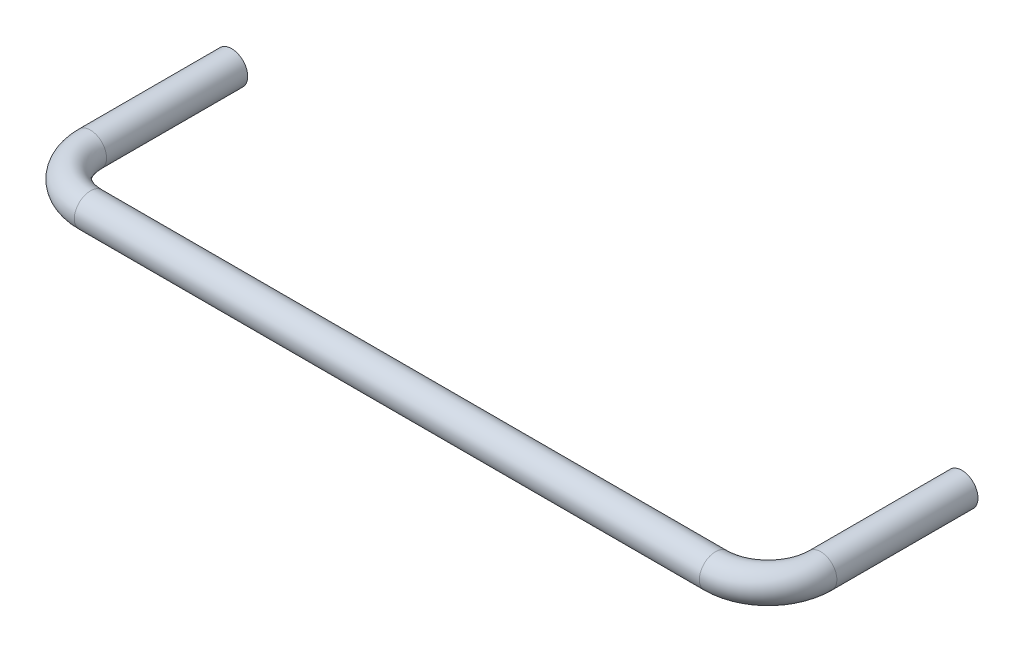
ISO-10303-21;
HEADER;
FILE_DESCRIPTION(('STEP AP214'),'2;1');
FILE_NAME('part.step','',(''),(''),'','','');
FILE_SCHEMA(('AUTOMOTIVE_DESIGN { 1 0 10303 214 1 1 1 1 }'));
ENDSEC;
DATA;
#1=APPLICATION_CONTEXT('core data for automotive mechanical design processes');
#2=APPLICATION_PROTOCOL_DEFINITION('international standard','automotive_design',2000,#1);
#3=PRODUCT_CONTEXT('',#1,'mechanical');
#4=PRODUCT('Part','Part','',(#3));
#5=PRODUCT_RELATED_PRODUCT_CATEGORY('part','',(#4));
#6=PRODUCT_DEFINITION_FORMATION('','',#4);
#7=PRODUCT_DEFINITION_CONTEXT('part definition',#1,'design');
#8=PRODUCT_DEFINITION('design','',#6,#7);
#9=PRODUCT_DEFINITION_SHAPE('','',#8);
#10=(LENGTH_UNIT() NAMED_UNIT(*) SI_UNIT(.MILLI.,.METRE.));
#11=(NAMED_UNIT(*) PLANE_ANGLE_UNIT() SI_UNIT($,.RADIAN.));
#12=(NAMED_UNIT(*) SI_UNIT($,.STERADIAN.) SOLID_ANGLE_UNIT());
#13=UNCERTAINTY_MEASURE_WITH_UNIT(LENGTH_MEASURE(1.E-05),#10,'distance_accuracy_value','');
#14=(GEOMETRIC_REPRESENTATION_CONTEXT(3) GLOBAL_UNCERTAINTY_ASSIGNED_CONTEXT((#13)) GLOBAL_UNIT_ASSIGNED_CONTEXT((#10,
#11,#12)) REPRESENTATION_CONTEXT('',''));
#15=CARTESIAN_POINT('',(0.,0.,0.));
#16=DIRECTION('',(0.,0.,1.));
#17=DIRECTION('',(1.,0.,0.));
#18=AXIS2_PLACEMENT_3D('',#15,#16,#17);
#19=CARTESIAN_POINT('',(9.055,0.,0.));
#20=DIRECTION('',(0.,0.,1.));
#21=DIRECTION('',(1.,0.,0.));
#22=AXIS2_PLACEMENT_3D('',#19,#20,#21);
#23=PLANE('',#22);
#24=CARTESIAN_POINT('',(9.055,0.,0.));
#25=DIRECTION('',(0.,0.,-1.));
#26=DIRECTION('',(-1.,0.,0.));
#27=AXIS2_PLACEMENT_3D('',#24,#25,#26);
#28=CIRCLE('',#27,0.4);
#29=CARTESIAN_POINT('',(9.455,0.,0.));
#30=VERTEX_POINT('',#29);
#31=EDGE_CURVE('E10',#30,#30,#28,.T.);
#32=ORIENTED_EDGE('',*,*,#31,.T.);
#33=EDGE_LOOP('',(#32));
#34=FACE_BOUND('',#33,.T.);
#35=ADVANCED_FACE('F16',(#34),#23,.F.);
#36=CARTESIAN_POINT('',(-9.055,0.,0.));
#37=DIRECTION('',(0.,0.,-1.));
#38=DIRECTION('',(-1.,0.,0.));
#39=AXIS2_PLACEMENT_3D('',#36,#37,#38);
#40=PLANE('',#39);
#41=CARTESIAN_POINT('',(-9.055,0.,0.));
#42=DIRECTION('',(0.,0.,-1.));
#43=DIRECTION('',(1.,0.,0.));
#44=AXIS2_PLACEMENT_3D('',#41,#42,#43);
#45=CIRCLE('',#44,0.4);
#46=CARTESIAN_POINT('',(-9.455,0.,0.));
#47=VERTEX_POINT('',#46);
#48=EDGE_CURVE('E123',#47,#47,#45,.T.);
#49=ORIENTED_EDGE('',*,*,#48,.T.);
#50=EDGE_LOOP('',(#49));
#51=FACE_BOUND('',#50,.T.);
#52=ADVANCED_FACE('F184',(#51),#40,.T.);
#53=CARTESIAN_POINT('',(9.055,0.,0.));
#54=DIRECTION('',(0.,0.,1.));
#55=DIRECTION('',(-1.,0.,0.));
#56=AXIS2_PLACEMENT_3D('',#53,#54,#55);
#57=CYLINDRICAL_SURFACE('',#56,0.4);
#58=CARTESIAN_POINT('',(9.055,0.,3.5));
#59=DIRECTION('',(0.,0.,1.));
#60=DIRECTION('',(-1.,0.,0.));
#61=AXIS2_PLACEMENT_3D('',#58,#59,#60);
#62=CIRCLE('',#61,0.4);
#63=CARTESIAN_POINT('',(9.455,0.,3.5));
#64=VERTEX_POINT('',#63);
#65=CARTESIAN_POINT('',(8.655,0.,3.5));
#66=VERTEX_POINT('',#65);
#67=EDGE_CURVE('E116',#64,#66,#62,.T.);
#68=ORIENTED_EDGE('',*,*,#67,.F.);
#69=DIRECTION('',(0.,0.,-1.));
#70=VECTOR('',#69,1.);
#71=CARTESIAN_POINT('',(9.455,0.,0.));
#72=LINE('',#71,#70);
#73=EDGE_CURVE('E20',#64,#30,#72,.T.);
#74=ORIENTED_EDGE('',*,*,#73,.T.);
#75=ORIENTED_EDGE('',*,*,#31,.F.);
#76=ORIENTED_EDGE('',*,*,#73,.F.);
#77=CARTESIAN_POINT('',(9.055,0.,3.5));
#78=DIRECTION('',(0.,0.,1.));
#79=DIRECTION('',(-1.,0.,0.));
#80=AXIS2_PLACEMENT_3D('',#77,#78,#79);
#81=CIRCLE('',#80,0.4);
#82=EDGE_CURVE('E112',#66,#64,#81,.T.);
#83=ORIENTED_EDGE('',*,*,#82,.F.);
#84=EDGE_LOOP('',(#68,#74,#75,#76,#83));
#85=FACE_BOUND('',#84,.T.);
#86=ADVANCED_FACE('F18',(#85),#57,.T.);
#87=CARTESIAN_POINT('',(7.75,0.,3.5));
#88=DIRECTION('',(0.,-1.,0.));
#89=DIRECTION('',(0.,0.,-1.));
#90=AXIS2_PLACEMENT_3D('',#87,#88,#89);
#91=TOROIDAL_SURFACE('',#90,1.305,0.4);
#92=CARTESIAN_POINT('',(7.75,0.,4.805));
#93=DIRECTION('',(-1.,0.,0.));
#94=DIRECTION('',(0.,0.,-1.));
#95=AXIS2_PLACEMENT_3D('',#92,#93,#94);
#96=CIRCLE('',#95,0.4);
#97=CARTESIAN_POINT('',(7.75,0.,5.205));
#98=VERTEX_POINT('',#97);
#99=CARTESIAN_POINT('',(7.75,0.,4.405));
#100=VERTEX_POINT('',#99);
#101=EDGE_CURVE('E96',#98,#100,#96,.T.);
#102=ORIENTED_EDGE('',*,*,#101,.F.);
#103=CARTESIAN_POINT('',(7.75,0.,4.805));
#104=DIRECTION('',(-1.,0.,0.));
#105=DIRECTION('',(0.,0.,-1.));
#106=AXIS2_PLACEMENT_3D('',#103,#104,#105);
#107=CIRCLE('',#106,0.4);
#108=EDGE_CURVE('E92',#100,#98,#107,.T.);
#109=ORIENTED_EDGE('',*,*,#108,.F.);
#110=CARTESIAN_POINT('',(7.75,0.,3.5));
#111=DIRECTION('',(0.,1.,0.));
#112=DIRECTION('',(0.,0.,-1.));
#113=AXIS2_PLACEMENT_3D('',#110,#111,#112);
#114=CIRCLE('',#113,0.905);
#115=EDGE_CURVE('E86',#100,#66,#114,.T.);
#116=ORIENTED_EDGE('',*,*,#115,.T.);
#117=ORIENTED_EDGE('',*,*,#82,.T.);
#118=ORIENTED_EDGE('',*,*,#67,.T.);
#119=ORIENTED_EDGE('',*,*,#115,.F.);
#120=EDGE_LOOP('',(#102,#109,#116,#117,#118,#119));
#121=FACE_BOUND('',#120,.T.);
#122=ADVANCED_FACE('F99',(#121),#91,.T.);
#123=CARTESIAN_POINT('',(7.75,0.,4.805));
#124=DIRECTION('',(-1.,0.,0.));
#125=DIRECTION('',(0.,0.,-1.));
#126=AXIS2_PLACEMENT_3D('',#123,#124,#125);
#127=CYLINDRICAL_SURFACE('',#126,0.4);
#128=CARTESIAN_POINT('',(-7.75,0.,4.805));
#129=DIRECTION('',(-1.,0.,0.));
#130=DIRECTION('',(0.,0.,-1.));
#131=AXIS2_PLACEMENT_3D('',#128,#129,#130);
#132=CIRCLE('',#131,0.4);
#133=CARTESIAN_POINT('',(-7.75,0.,5.205));
#134=VERTEX_POINT('',#133);
#135=CARTESIAN_POINT('',(-7.75,0.,4.405));
#136=VERTEX_POINT('',#135);
#137=EDGE_CURVE('E53',#134,#136,#132,.T.);
#138=ORIENTED_EDGE('',*,*,#137,.F.);
#139=DIRECTION('',(1.,0.,0.));
#140=VECTOR('',#139,1.);
#141=CARTESIAN_POINT('',(7.75,0.,5.205));
#142=LINE('',#141,#140);
#143=EDGE_CURVE('E95',#134,#98,#142,.T.);
#144=ORIENTED_EDGE('',*,*,#143,.T.);
#145=ORIENTED_EDGE('',*,*,#101,.T.);
#146=ORIENTED_EDGE('',*,*,#108,.T.);
#147=ORIENTED_EDGE('',*,*,#143,.F.);
#148=CARTESIAN_POINT('',(-7.75,0.,4.805));
#149=DIRECTION('',(-1.,0.,0.));
#150=DIRECTION('',(0.,0.,-1.));
#151=AXIS2_PLACEMENT_3D('',#148,#149,#150);
#152=CIRCLE('',#151,0.4);
#153=EDGE_CURVE('E108',#136,#134,#152,.T.);
#154=ORIENTED_EDGE('',*,*,#153,.F.);
#155=EDGE_LOOP('',(#138,#144,#145,#146,#147,#154));
#156=FACE_BOUND('',#155,.T.);
#157=ADVANCED_FACE('F93',(#156),#127,.T.);
#158=CARTESIAN_POINT('',(-7.75,0.,3.5));
#159=DIRECTION('',(0.,-1.,0.));
#160=DIRECTION('',(0.,0.,-1.));
#161=AXIS2_PLACEMENT_3D('',#158,#159,#160);
#162=TOROIDAL_SURFACE('',#161,1.305,0.4);
#163=CARTESIAN_POINT('',(-9.055,0.,3.5));
#164=DIRECTION('',(0.,0.,-1.));
#165=DIRECTION('',(1.,0.,0.));
#166=AXIS2_PLACEMENT_3D('',#163,#164,#165);
#167=CIRCLE('',#166,0.4);
#168=CARTESIAN_POINT('',(-9.455,0.,3.5));
#169=VERTEX_POINT('',#168);
#170=CARTESIAN_POINT('',(-8.655,0.,3.5));
#171=VERTEX_POINT('',#170);
#172=EDGE_CURVE('E122',#169,#171,#167,.T.);
#173=ORIENTED_EDGE('',*,*,#172,.F.);
#174=CARTESIAN_POINT('',(-9.055,0.,3.5));
#175=DIRECTION('',(0.,0.,-1.));
#176=DIRECTION('',(1.,0.,0.));
#177=AXIS2_PLACEMENT_3D('',#174,#175,#176);
#178=CIRCLE('',#177,0.4);
#179=EDGE_CURVE('E75',#171,#169,#178,.T.);
#180=ORIENTED_EDGE('',*,*,#179,.F.);
#181=CARTESIAN_POINT('',(-7.75,0.,3.5));
#182=DIRECTION('',(0.,1.,0.));
#183=DIRECTION('',(0.,0.,-1.));
#184=AXIS2_PLACEMENT_3D('',#181,#182,#183);
#185=CIRCLE('',#184,0.905);
#186=EDGE_CURVE('E63',#171,#136,#185,.T.);
#187=ORIENTED_EDGE('',*,*,#186,.T.);
#188=ORIENTED_EDGE('',*,*,#153,.T.);
#189=ORIENTED_EDGE('',*,*,#137,.T.);
#190=ORIENTED_EDGE('',*,*,#186,.F.);
#191=EDGE_LOOP('',(#173,#180,#187,#188,#189,#190));
#192=FACE_BOUND('',#191,.T.);
#193=ADVANCED_FACE('F199',(#192),#162,.T.);
#194=CARTESIAN_POINT('',(-9.055,0.,3.5));
#195=DIRECTION('',(0.,0.,-1.));
#196=DIRECTION('',(1.,0.,0.));
#197=AXIS2_PLACEMENT_3D('',#194,#195,#196);
#198=CYLINDRICAL_SURFACE('',#197,0.4);
#199=ORIENTED_EDGE('',*,*,#48,.F.);
#200=DIRECTION('',(0.,0.,1.));
#201=VECTOR('',#200,1.);
#202=CARTESIAN_POINT('',(-9.455,0.,3.5));
#203=LINE('',#202,#201);
#204=EDGE_CURVE('E119',#47,#169,#203,.T.);
#205=ORIENTED_EDGE('',*,*,#204,.T.);
#206=ORIENTED_EDGE('',*,*,#172,.T.);
#207=ORIENTED_EDGE('',*,*,#179,.T.);
#208=ORIENTED_EDGE('',*,*,#204,.F.);
#209=EDGE_LOOP('',(#199,#205,#206,#207,#208));
#210=FACE_BOUND('',#209,.T.);
#211=ADVANCED_FACE('F208',(#210),#198,.T.);
#212=CLOSED_SHELL('',(#35,#52,#86,#122,#157,#193,#211));
#213=MANIFOLD_SOLID_BREP('B1',#212);
#214=ADVANCED_BREP_SHAPE_REPRESENTATION('',(#18,#213),#14);
#215=SHAPE_DEFINITION_REPRESENTATION(#9,#214);
ENDSEC;
END-ISO-10303-21;
